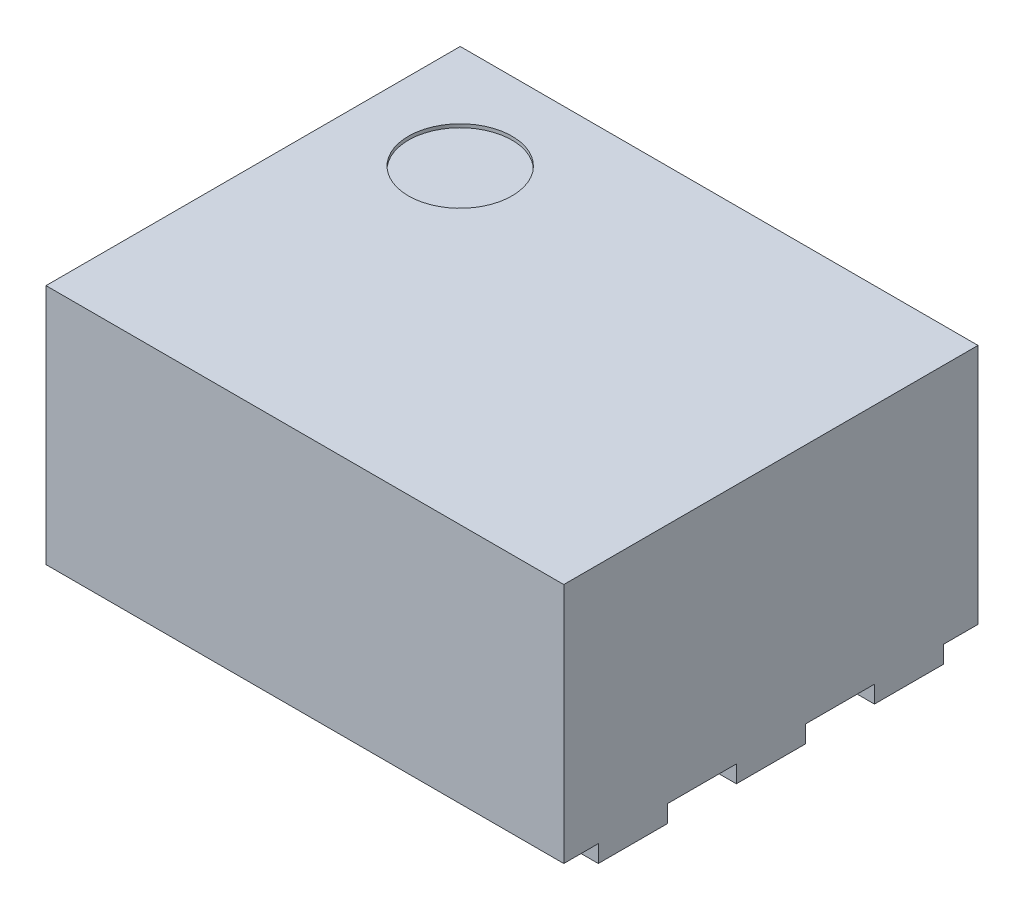
ISO-10303-21;
HEADER;
FILE_DESCRIPTION(('STEP AP214'),'2;1');
FILE_NAME('part.step','',(''),(''),'','','');
FILE_SCHEMA(('AUTOMOTIVE_DESIGN { 1 0 10303 214 1 1 1 1 }'));
ENDSEC;
DATA;
#1=APPLICATION_CONTEXT('core data for automotive mechanical design processes');
#2=APPLICATION_PROTOCOL_DEFINITION('international standard','automotive_design',2000,#1);
#3=PRODUCT_CONTEXT('',#1,'mechanical');
#4=PRODUCT('Part','Part','',(#3));
#5=PRODUCT_RELATED_PRODUCT_CATEGORY('part','',(#4));
#6=PRODUCT_DEFINITION_FORMATION('','',#4);
#7=PRODUCT_DEFINITION_CONTEXT('part definition',#1,'design');
#8=PRODUCT_DEFINITION('design','',#6,#7);
#9=PRODUCT_DEFINITION_SHAPE('','',#8);
#10=(LENGTH_UNIT() NAMED_UNIT(*) SI_UNIT(.MILLI.,.METRE.));
#11=(NAMED_UNIT(*) PLANE_ANGLE_UNIT() SI_UNIT($,.RADIAN.));
#12=(NAMED_UNIT(*) SI_UNIT($,.STERADIAN.) SOLID_ANGLE_UNIT());
#13=UNCERTAINTY_MEASURE_WITH_UNIT(LENGTH_MEASURE(1.E-05),#10,'distance_accuracy_value','');
#14=(GEOMETRIC_REPRESENTATION_CONTEXT(3) GLOBAL_UNCERTAINTY_ASSIGNED_CONTEXT((#13)) GLOBAL_UNIT_ASSIGNED_CONTEXT((#10,
#11,#12)) REPRESENTATION_CONTEXT('',''));
#15=CARTESIAN_POINT('',(0.,0.,0.));
#16=DIRECTION('',(0.,0.,1.));
#17=DIRECTION('',(1.,0.,0.));
#18=AXIS2_PLACEMENT_3D('',#15,#16,#17);
#19=CARTESIAN_POINT('',(0.,0.,0.));
#20=DIRECTION('',(0.,1.,0.));
#21=DIRECTION('',(0.,0.,1.));
#22=AXIS2_PLACEMENT_3D('',#19,#20,#21);
#23=PLANE('',#22);
#24=DIRECTION('',(0.,0.,1.));
#25=VECTOR('',#24,1.);
#26=CARTESIAN_POINT('',(0.235,0.,-0.425));
#27=LINE('',#26,#25);
#28=CARTESIAN_POINT('',(0.235,0.,-0.425));
#29=VERTEX_POINT('',#28);
#30=CARTESIAN_POINT('',(0.235,0.,0.425));
#31=VERTEX_POINT('',#30);
#32=EDGE_CURVE('E483',#29,#31,#27,.T.);
#33=ORIENTED_EDGE('',*,*,#32,.F.);
#34=DIRECTION('',(1.,0.,0.));
#35=VECTOR('',#34,1.);
#36=CARTESIAN_POINT('',(-0.235,0.,-0.425));
#37=LINE('',#36,#35);
#38=CARTESIAN_POINT('',(-0.235,0.,-0.425));
#39=VERTEX_POINT('',#38);
#40=EDGE_CURVE('E470',#39,#29,#37,.T.);
#41=ORIENTED_EDGE('',*,*,#40,.F.);
#42=DIRECTION('',(0.,0.,-1.));
#43=VECTOR('',#42,1.);
#44=CARTESIAN_POINT('',(-0.235,0.,-0.425));
#45=LINE('',#44,#43);
#46=CARTESIAN_POINT('',(-0.235,0.,0.425));
#47=VERTEX_POINT('',#46);
#48=EDGE_CURVE('E474',#47,#39,#45,.T.);
#49=ORIENTED_EDGE('',*,*,#48,.F.);
#50=DIRECTION('',(-1.,0.,0.));
#51=VECTOR('',#50,1.);
#52=CARTESIAN_POINT('',(-0.235,0.,0.425));
#53=LINE('',#52,#51);
#54=EDGE_CURVE('E479',#31,#47,#53,.T.);
#55=ORIENTED_EDGE('',*,*,#54,.F.);
#56=EDGE_LOOP('',(#33,#41,#49,#55));
#57=FACE_BOUND('',#56,.T.);
#58=DIRECTION('',(-1.,0.,0.));
#59=VECTOR('',#58,1.);
#60=CARTESIAN_POINT('',(0.75,0.,0.5));
#61=LINE('',#60,#59);
#62=CARTESIAN_POINT('',(0.75,0.,0.5));
#63=VERTEX_POINT('',#62);
#64=CARTESIAN_POINT('',(0.46,0.,0.5));
#65=VERTEX_POINT('',#64);
#66=EDGE_CURVE('E275',#63,#65,#61,.T.);
#67=ORIENTED_EDGE('',*,*,#66,.F.);
#68=DIRECTION('',(0.,0.,-1.));
#69=VECTOR('',#68,1.);
#70=CARTESIAN_POINT('',(0.75,0.,-0.6));
#71=LINE('',#70,#69);
#72=CARTESIAN_POINT('',(0.75,0.,0.6));
#73=VERTEX_POINT('',#72);
#74=EDGE_CURVE('E555',#73,#63,#71,.T.);
#75=ORIENTED_EDGE('',*,*,#74,.F.);
#76=DIRECTION('',(1.,0.,0.));
#77=VECTOR('',#76,1.);
#78=CARTESIAN_POINT('',(-0.75,0.,0.6));
#79=LINE('',#78,#77);
#80=CARTESIAN_POINT('',(-0.75,0.,0.6));
#81=VERTEX_POINT('',#80);
#82=EDGE_CURVE('E545',#81,#73,#79,.T.);
#83=ORIENTED_EDGE('',*,*,#82,.F.);
#84=DIRECTION('',(0.,0.,1.));
#85=VECTOR('',#84,1.);
#86=CARTESIAN_POINT('',(-0.75,0.,-0.6));
#87=LINE('',#86,#85);
#88=CARTESIAN_POINT('',(-0.75,0.,0.5));
#89=VERTEX_POINT('',#88);
#90=EDGE_CURVE('E562',#89,#81,#87,.T.);
#91=ORIENTED_EDGE('',*,*,#90,.F.);
#92=DIRECTION('',(-1.,0.,0.));
#93=VECTOR('',#92,1.);
#94=CARTESIAN_POINT('',(-0.75,0.,0.5));
#95=LINE('',#94,#93);
#96=CARTESIAN_POINT('',(-0.46,0.,0.5));
#97=VERTEX_POINT('',#96);
#98=EDGE_CURVE('E504',#97,#89,#95,.T.);
#99=ORIENTED_EDGE('',*,*,#98,.F.);
#100=DIRECTION('',(0.,0.,1.));
#101=VECTOR('',#100,1.);
#102=CARTESIAN_POINT('',(-0.46,0.,0.5));
#103=LINE('',#102,#101);
#104=CARTESIAN_POINT('',(-0.46,0.,0.3));
#105=VERTEX_POINT('',#104);
#106=EDGE_CURVE('E517',#105,#97,#103,.T.);
#107=ORIENTED_EDGE('',*,*,#106,.F.);
#108=DIRECTION('',(1.,0.,0.));
#109=VECTOR('',#108,1.);
#110=CARTESIAN_POINT('',(-0.75,0.,0.3));
#111=LINE('',#110,#109);
#112=CARTESIAN_POINT('',(-0.75,0.,0.3));
#113=VERTEX_POINT('',#112);
#114=EDGE_CURVE('E487',#113,#105,#111,.T.);
#115=ORIENTED_EDGE('',*,*,#114,.F.);
#116=CARTESIAN_POINT('',(-0.75,0.,0.0999999999999999));
#117=VERTEX_POINT('',#116);
#118=EDGE_CURVE('E610',#117,#113,#87,.T.);
#119=ORIENTED_EDGE('',*,*,#118,.F.);
#120=DIRECTION('',(-1.,0.,0.));
#121=VECTOR('',#120,1.);
#122=CARTESIAN_POINT('',(-0.75,0.,0.1));
#123=LINE('',#122,#121);
#124=CARTESIAN_POINT('',(-0.46,0.,0.1));
#125=VERTEX_POINT('',#124);
#126=EDGE_CURVE('E431',#125,#117,#123,.T.);
#127=ORIENTED_EDGE('',*,*,#126,.F.);
#128=DIRECTION('',(0.,0.,1.));
#129=VECTOR('',#128,1.);
#130=CARTESIAN_POINT('',(-0.46,0.,0.1));
#131=LINE('',#130,#129);
#132=CARTESIAN_POINT('',(-0.46,0.,-0.1));
#133=VERTEX_POINT('',#132);
#134=EDGE_CURVE('E435',#133,#125,#131,.T.);
#135=ORIENTED_EDGE('',*,*,#134,.F.);
#136=DIRECTION('',(1.,0.,0.));
#137=VECTOR('',#136,1.);
#138=CARTESIAN_POINT('',(-0.75,0.,-0.1));
#139=LINE('',#138,#137);
#140=CARTESIAN_POINT('',(-0.75,0.,-0.1));
#141=VERTEX_POINT('',#140);
#142=EDGE_CURVE('E439',#141,#133,#139,.T.);
#143=ORIENTED_EDGE('',*,*,#142,.F.);
#144=CARTESIAN_POINT('',(-0.75,0.,-0.3));
#145=VERTEX_POINT('',#144);
#146=EDGE_CURVE('E567',#145,#141,#87,.T.);
#147=ORIENTED_EDGE('',*,*,#146,.F.);
#148=DIRECTION('',(-1.,0.,0.));
#149=VECTOR('',#148,1.);
#150=CARTESIAN_POINT('',(-0.75,0.,-0.3));
#151=LINE('',#150,#149);
#152=CARTESIAN_POINT('',(-0.46,0.,-0.3));
#153=VERTEX_POINT('',#152);
#154=EDGE_CURVE('E355',#153,#145,#151,.T.);
#155=ORIENTED_EDGE('',*,*,#154,.F.);
#156=DIRECTION('',(0.,0.,1.));
#157=VECTOR('',#156,1.);
#158=CARTESIAN_POINT('',(-0.46,0.,-0.5));
#159=LINE('',#158,#157);
#160=CARTESIAN_POINT('',(-0.46,0.,-0.5));
#161=VERTEX_POINT('',#160);
#162=EDGE_CURVE('E359',#161,#153,#159,.T.);
#163=ORIENTED_EDGE('',*,*,#162,.F.);
#164=DIRECTION('',(1.,0.,0.));
#165=VECTOR('',#164,1.);
#166=CARTESIAN_POINT('',(-0.75,0.,-0.5));
#167=LINE('',#166,#165);
#168=CARTESIAN_POINT('',(-0.75,0.,-0.5));
#169=VERTEX_POINT('',#168);
#170=EDGE_CURVE('E363',#169,#161,#167,.T.);
#171=ORIENTED_EDGE('',*,*,#170,.F.);
#172=CARTESIAN_POINT('',(-0.75,0.,-0.6));
#173=VERTEX_POINT('',#172);
#174=EDGE_CURVE('E563',#173,#169,#87,.T.);
#175=ORIENTED_EDGE('',*,*,#174,.F.);
#176=DIRECTION('',(-1.,0.,0.));
#177=VECTOR('',#176,1.);
#178=CARTESIAN_POINT('',(-0.75,0.,-0.6));
#179=LINE('',#178,#177);
#180=CARTESIAN_POINT('',(0.75,0.,-0.6));
#181=VERTEX_POINT('',#180);
#182=EDGE_CURVE('E559',#181,#173,#179,.T.);
#183=ORIENTED_EDGE('',*,*,#182,.F.);
#184=CARTESIAN_POINT('',(0.75,0.,-0.5));
#185=VERTEX_POINT('',#184);
#186=EDGE_CURVE('E539',#185,#181,#71,.T.);
#187=ORIENTED_EDGE('',*,*,#186,.F.);
#188=DIRECTION('',(1.,0.,0.));
#189=VECTOR('',#188,1.);
#190=CARTESIAN_POINT('',(0.75,0.,-0.5));
#191=LINE('',#190,#189);
#192=CARTESIAN_POINT('',(0.46,0.,-0.5));
#193=VERTEX_POINT('',#192);
#194=EDGE_CURVE('E401',#193,#185,#191,.T.);
#195=ORIENTED_EDGE('',*,*,#194,.F.);
#196=DIRECTION('',(0.,0.,-1.));
#197=VECTOR('',#196,1.);
#198=CARTESIAN_POINT('',(0.46,0.,-0.5));
#199=LINE('',#198,#197);
#200=CARTESIAN_POINT('',(0.46,0.,-0.3));
#201=VERTEX_POINT('',#200);
#202=EDGE_CURVE('E394',#201,#193,#199,.T.);
#203=ORIENTED_EDGE('',*,*,#202,.F.);
#204=DIRECTION('',(-1.,0.,0.));
#205=VECTOR('',#204,1.);
#206=CARTESIAN_POINT('',(0.75,0.,-0.3));
#207=LINE('',#206,#205);
#208=CARTESIAN_POINT('',(0.75,0.,-0.3));
#209=VERTEX_POINT('',#208);
#210=EDGE_CURVE('E397',#209,#201,#207,.T.);
#211=ORIENTED_EDGE('',*,*,#210,.F.);
#212=CARTESIAN_POINT('',(0.75,0.,-0.0999999999999999));
#213=VERTEX_POINT('',#212);
#214=EDGE_CURVE('E1223',#213,#209,#71,.T.);
#215=ORIENTED_EDGE('',*,*,#214,.F.);
#216=DIRECTION('',(1.,0.,0.));
#217=VECTOR('',#216,1.);
#218=CARTESIAN_POINT('',(0.75,0.,-0.0999999999999999));
#219=LINE('',#218,#217);
#220=CARTESIAN_POINT('',(0.46,0.,-0.0999999999999999));
#221=VERTEX_POINT('',#220);
#222=EDGE_CURVE('E319',#221,#213,#219,.T.);
#223=ORIENTED_EDGE('',*,*,#222,.F.);
#224=DIRECTION('',(0.,0.,-1.));
#225=VECTOR('',#224,1.);
#226=CARTESIAN_POINT('',(0.46,0.,0.1));
#227=LINE('',#226,#225);
#228=CARTESIAN_POINT('',(0.46,0.,0.1));
#229=VERTEX_POINT('',#228);
#230=EDGE_CURVE('E322',#229,#221,#227,.T.);
#231=ORIENTED_EDGE('',*,*,#230,.F.);
#232=DIRECTION('',(-1.,0.,0.));
#233=VECTOR('',#232,1.);
#234=CARTESIAN_POINT('',(0.75,0.,0.1));
#235=LINE('',#234,#233);
#236=CARTESIAN_POINT('',(0.75,0.,0.1));
#237=VERTEX_POINT('',#236);
#238=EDGE_CURVE('E326',#237,#229,#235,.T.);
#239=ORIENTED_EDGE('',*,*,#238,.F.);
#240=CARTESIAN_POINT('',(0.75,0.,0.3));
#241=VERTEX_POINT('',#240);
#242=EDGE_CURVE('E285',#241,#237,#71,.T.);
#243=ORIENTED_EDGE('',*,*,#242,.F.);
#244=DIRECTION('',(1.,0.,0.));
#245=VECTOR('',#244,1.);
#246=CARTESIAN_POINT('',(0.75,0.,0.3));
#247=LINE('',#246,#245);
#248=CARTESIAN_POINT('',(0.46,0.,0.3));
#249=VERTEX_POINT('',#248);
#250=EDGE_CURVE('E276',#249,#241,#247,.T.);
#251=ORIENTED_EDGE('',*,*,#250,.F.);
#252=DIRECTION('',(0.,0.,-1.));
#253=VECTOR('',#252,1.);
#254=CARTESIAN_POINT('',(0.46,0.,0.5));
#255=LINE('',#254,#253);
#256=EDGE_CURVE('E263',#65,#249,#255,.T.);
#257=ORIENTED_EDGE('',*,*,#256,.F.);
#258=EDGE_LOOP('',(#67,#75,#83,#91,#99,#107,#115,#119,#127,#135,#143,#147,#155,#163,#171,#175,
#183,#187,#195,#203,#211,#215,#223,#231,#239,#243,#251,#257));
#259=FACE_BOUND('',#258,.T.);
#260=ADVANCED_FACE('F51',(#57,#259),#23,.F.);
#261=CARTESIAN_POINT('',(0.75,0.7,-0.6));
#262=DIRECTION('',(-1.,0.,0.));
#263=DIRECTION('',(0.,0.,1.));
#264=AXIS2_PLACEMENT_3D('',#261,#262,#263);
#265=PLANE('',#264);
#266=ORIENTED_EDGE('',*,*,#74,.T.);
#267=DIRECTION('',(0.,1.,0.));
#268=VECTOR('',#267,1.);
#269=CARTESIAN_POINT('',(0.75,-0.05,0.5));
#270=LINE('',#269,#268);
#271=CARTESIAN_POINT('',(0.75,-0.05,0.5));
#272=VERTEX_POINT('',#271);
#273=EDGE_CURVE('E625',#272,#63,#270,.T.);
#274=ORIENTED_EDGE('',*,*,#273,.F.);
#275=DIRECTION('',(0.,0.,1.));
#276=VECTOR('',#275,1.);
#277=CARTESIAN_POINT('',(0.75,-0.05,0.5));
#278=LINE('',#277,#276);
#279=CARTESIAN_POINT('',(0.75,-0.05,0.3));
#280=VERTEX_POINT('',#279);
#281=EDGE_CURVE('E287',#280,#272,#278,.T.);
#282=ORIENTED_EDGE('',*,*,#281,.F.);
#283=DIRECTION('',(0.,1.,0.));
#284=VECTOR('',#283,1.);
#285=CARTESIAN_POINT('',(0.75,-0.05,0.3));
#286=LINE('',#285,#284);
#287=EDGE_CURVE('E67',#280,#241,#286,.T.);
#288=ORIENTED_EDGE('',*,*,#287,.T.);
#289=ORIENTED_EDGE('',*,*,#242,.T.);
#290=DIRECTION('',(0.,1.,0.));
#291=VECTOR('',#290,1.);
#292=CARTESIAN_POINT('',(0.75,-0.05,0.1));
#293=LINE('',#292,#291);
#294=CARTESIAN_POINT('',(0.75,-0.05,0.1));
#295=VERTEX_POINT('',#294);
#296=EDGE_CURVE('E297',#295,#237,#293,.T.);
#297=ORIENTED_EDGE('',*,*,#296,.F.);
#298=DIRECTION('',(0.,0.,1.));
#299=VECTOR('',#298,1.);
#300=CARTESIAN_POINT('',(0.75,-0.05,0.1));
#301=LINE('',#300,#299);
#302=CARTESIAN_POINT('',(0.75,-0.05,-0.0999999999999999));
#303=VERTEX_POINT('',#302);
#304=EDGE_CURVE('E323',#303,#295,#301,.T.);
#305=ORIENTED_EDGE('',*,*,#304,.F.);
#306=DIRECTION('',(0.,1.,0.));
#307=VECTOR('',#306,1.);
#308=CARTESIAN_POINT('',(0.75,-0.05,-0.0999999999999999));
#309=LINE('',#308,#307);
#310=EDGE_CURVE('E74',#303,#213,#309,.T.);
#311=ORIENTED_EDGE('',*,*,#310,.T.);
#312=ORIENTED_EDGE('',*,*,#214,.T.);
#313=DIRECTION('',(0.,1.,0.));
#314=VECTOR('',#313,1.);
#315=CARTESIAN_POINT('',(0.75,-0.05,-0.3));
#316=LINE('',#315,#314);
#317=CARTESIAN_POINT('',(0.75,-0.05,-0.3));
#318=VERTEX_POINT('',#317);
#319=EDGE_CURVE('E381',#318,#209,#316,.T.);
#320=ORIENTED_EDGE('',*,*,#319,.F.);
#321=DIRECTION('',(0.,0.,1.));
#322=VECTOR('',#321,1.);
#323=CARTESIAN_POINT('',(0.75,-0.05,-0.5));
#324=LINE('',#323,#322);
#325=CARTESIAN_POINT('',(0.75,-0.05,-0.5));
#326=VERTEX_POINT('',#325);
#327=EDGE_CURVE('E410',#326,#318,#324,.T.);
#328=ORIENTED_EDGE('',*,*,#327,.F.);
#329=DIRECTION('',(0.,1.,0.));
#330=VECTOR('',#329,1.);
#331=CARTESIAN_POINT('',(0.75,-0.05,-0.5));
#332=LINE('',#331,#330);
#333=EDGE_CURVE('E366',#326,#185,#332,.T.);
#334=ORIENTED_EDGE('',*,*,#333,.T.);
#335=ORIENTED_EDGE('',*,*,#186,.T.);
#336=DIRECTION('',(0.,-1.,0.));
#337=VECTOR('',#336,1.);
#338=CARTESIAN_POINT('',(0.75,0.7,-0.6));
#339=LINE('',#338,#337);
#340=CARTESIAN_POINT('',(0.75,0.7,-0.6));
#341=VERTEX_POINT('',#340);
#342=EDGE_CURVE('E11',#341,#181,#339,.T.);
#343=ORIENTED_EDGE('',*,*,#342,.F.);
#344=DIRECTION('',(0.,0.,-1.));
#345=VECTOR('',#344,1.);
#346=CARTESIAN_POINT('',(0.75,0.7,-0.6));
#347=LINE('',#346,#345);
#348=CARTESIAN_POINT('',(0.75,0.7,0.6));
#349=VERTEX_POINT('',#348);
#350=EDGE_CURVE('E540',#349,#341,#347,.T.);
#351=ORIENTED_EDGE('',*,*,#350,.F.);
#352=DIRECTION('',(0.,-1.,0.));
#353=VECTOR('',#352,1.);
#354=CARTESIAN_POINT('',(0.75,0.7,0.6));
#355=LINE('',#354,#353);
#356=EDGE_CURVE('E554',#349,#73,#355,.T.);
#357=ORIENTED_EDGE('',*,*,#356,.T.);
#358=EDGE_LOOP('',(#266,#274,#282,#288,#289,#297,#305,#311,#312,#320,#328,#334,#335,#343,#351,#357));
#359=FACE_BOUND('',#358,.T.);
#360=ADVANCED_FACE('F53',(#359),#265,.F.);
#361=CARTESIAN_POINT('',(-0.75,0.7,-0.6));
#362=DIRECTION('',(0.,0.,1.));
#363=DIRECTION('',(1.,0.,0.));
#364=AXIS2_PLACEMENT_3D('',#361,#362,#363);
#365=PLANE('',#364);
#366=ORIENTED_EDGE('',*,*,#182,.T.);
#367=DIRECTION('',(0.,-1.,0.));
#368=VECTOR('',#367,1.);
#369=CARTESIAN_POINT('',(-0.75,0.7,-0.6));
#370=LINE('',#369,#368);
#371=CARTESIAN_POINT('',(-0.75,0.7,-0.6));
#372=VERTEX_POINT('',#371);
#373=EDGE_CURVE('E60',#372,#173,#370,.T.);
#374=ORIENTED_EDGE('',*,*,#373,.F.);
#375=DIRECTION('',(-1.,0.,0.));
#376=VECTOR('',#375,1.);
#377=CARTESIAN_POINT('',(-0.75,0.7,-0.6));
#378=LINE('',#377,#376);
#379=EDGE_CURVE('E544',#341,#372,#378,.T.);
#380=ORIENTED_EDGE('',*,*,#379,.F.);
#381=ORIENTED_EDGE('',*,*,#342,.T.);
#382=EDGE_LOOP('',(#366,#374,#380,#381));
#383=FACE_BOUND('',#382,.T.);
#384=ADVANCED_FACE('F630',(#383),#365,.F.);
#385=CARTESIAN_POINT('',(-0.75,0.7,-0.6));
#386=DIRECTION('',(1.,0.,0.));
#387=DIRECTION('',(0.,0.,-1.));
#388=AXIS2_PLACEMENT_3D('',#385,#386,#387);
#389=PLANE('',#388);
#390=ORIENTED_EDGE('',*,*,#174,.T.);
#391=DIRECTION('',(0.,1.,0.));
#392=VECTOR('',#391,1.);
#393=CARTESIAN_POINT('',(-0.75,-0.05,-0.5));
#394=LINE('',#393,#392);
#395=CARTESIAN_POINT('',(-0.75,-0.05,-0.5));
#396=VERTEX_POINT('',#395);
#397=EDGE_CURVE('E329',#396,#169,#394,.T.);
#398=ORIENTED_EDGE('',*,*,#397,.F.);
#399=DIRECTION('',(0.,0.,-1.));
#400=VECTOR('',#399,1.);
#401=CARTESIAN_POINT('',(-0.75,-0.05,-0.5));
#402=LINE('',#401,#400);
#403=CARTESIAN_POINT('',(-0.75,-0.05,-0.3));
#404=VERTEX_POINT('',#403);
#405=EDGE_CURVE('E360',#404,#396,#402,.T.);
#406=ORIENTED_EDGE('',*,*,#405,.F.);
#407=DIRECTION('',(0.,1.,0.));
#408=VECTOR('',#407,1.);
#409=CARTESIAN_POINT('',(-0.75,-0.05,-0.3));
#410=LINE('',#409,#408);
#411=EDGE_CURVE('E351',#404,#145,#410,.T.);
#412=ORIENTED_EDGE('',*,*,#411,.T.);
#413=ORIENTED_EDGE('',*,*,#146,.T.);
#414=DIRECTION('',(0.,1.,0.));
#415=VECTOR('',#414,1.);
#416=CARTESIAN_POINT('',(-0.75,-0.05,-0.1));
#417=LINE('',#416,#415);
#418=CARTESIAN_POINT('',(-0.75,-0.05,-0.1));
#419=VERTEX_POINT('',#418);
#420=EDGE_CURVE('E404',#419,#141,#417,.T.);
#421=ORIENTED_EDGE('',*,*,#420,.F.);
#422=DIRECTION('',(0.,0.,-1.));
#423=VECTOR('',#422,1.);
#424=CARTESIAN_POINT('',(-0.75,-0.05,0.1));
#425=LINE('',#424,#423);
#426=CARTESIAN_POINT('',(-0.75,-0.05,0.1));
#427=VERTEX_POINT('',#426);
#428=EDGE_CURVE('E436',#427,#419,#425,.T.);
#429=ORIENTED_EDGE('',*,*,#428,.F.);
#430=DIRECTION('',(0.,1.,0.));
#431=VECTOR('',#430,1.);
#432=CARTESIAN_POINT('',(-0.75,-0.05,0.1));
#433=LINE('',#432,#431);
#434=EDGE_CURVE('E427',#427,#117,#433,.T.);
#435=ORIENTED_EDGE('',*,*,#434,.T.);
#436=ORIENTED_EDGE('',*,*,#118,.T.);
#437=DIRECTION('',(0.,1.,0.));
#438=VECTOR('',#437,1.);
#439=CARTESIAN_POINT('',(-0.75,-0.05,0.3));
#440=LINE('',#439,#438);
#441=CARTESIAN_POINT('',(-0.75,-0.05,0.3));
#442=VERTEX_POINT('',#441);
#443=EDGE_CURVE('E535',#442,#113,#440,.T.);
#444=ORIENTED_EDGE('',*,*,#443,.F.);
#445=DIRECTION('',(0.,0.,-1.));
#446=VECTOR('',#445,1.);
#447=CARTESIAN_POINT('',(-0.75,-0.05,0.5));
#448=LINE('',#447,#446);
#449=CARTESIAN_POINT('',(-0.75,-0.05,0.5));
#450=VERTEX_POINT('',#449);
#451=EDGE_CURVE('E499',#450,#442,#448,.T.);
#452=ORIENTED_EDGE('',*,*,#451,.F.);
#453=DIRECTION('',(0.,1.,0.));
#454=VECTOR('',#453,1.);
#455=CARTESIAN_POINT('',(-0.75,-0.05,0.5));
#456=LINE('',#455,#454);
#457=EDGE_CURVE('E513',#450,#89,#456,.T.);
#458=ORIENTED_EDGE('',*,*,#457,.T.);
#459=ORIENTED_EDGE('',*,*,#90,.T.);
#460=DIRECTION('',(0.,-1.,0.));
#461=VECTOR('',#460,1.);
#462=CARTESIAN_POINT('',(-0.75,0.7,0.6));
#463=LINE('',#462,#461);
#464=CARTESIAN_POINT('',(-0.75,0.7,0.6));
#465=VERTEX_POINT('',#464);
#466=EDGE_CURVE('E573',#465,#81,#463,.T.);
#467=ORIENTED_EDGE('',*,*,#466,.F.);
#468=DIRECTION('',(0.,0.,1.));
#469=VECTOR('',#468,1.);
#470=CARTESIAN_POINT('',(-0.75,0.7,-0.6));
#471=LINE('',#470,#469);
#472=EDGE_CURVE('E548',#372,#465,#471,.T.);
#473=ORIENTED_EDGE('',*,*,#472,.F.);
#474=ORIENTED_EDGE('',*,*,#373,.T.);
#475=EDGE_LOOP('',(#390,#398,#406,#412,#413,#421,#429,#435,#436,#444,#452,#458,#459,#467,#473,#474));
#476=FACE_BOUND('',#475,.T.);
#477=ADVANCED_FACE('F582',(#476),#389,.F.);
#478=CARTESIAN_POINT('',(-0.75,0.7,0.6));
#479=DIRECTION('',(0.,0.,-1.));
#480=DIRECTION('',(-1.,0.,0.));
#481=AXIS2_PLACEMENT_3D('',#478,#479,#480);
#482=PLANE('',#481);
#483=ORIENTED_EDGE('',*,*,#82,.T.);
#484=ORIENTED_EDGE('',*,*,#356,.F.);
#485=DIRECTION('',(1.,0.,0.));
#486=VECTOR('',#485,1.);
#487=CARTESIAN_POINT('',(-0.75,0.7,0.6));
#488=LINE('',#487,#486);
#489=EDGE_CURVE('E551',#465,#349,#488,.T.);
#490=ORIENTED_EDGE('',*,*,#489,.F.);
#491=ORIENTED_EDGE('',*,*,#466,.T.);
#492=EDGE_LOOP('',(#483,#484,#490,#491));
#493=FACE_BOUND('',#492,.T.);
#494=ADVANCED_FACE('F621',(#493),#482,.F.);
#495=CARTESIAN_POINT('',(0.,0.7,0.));
#496=DIRECTION('',(0.,1.,0.));
#497=DIRECTION('',(0.,0.,1.));
#498=AXIS2_PLACEMENT_3D('',#495,#496,#497);
#499=PLANE('',#498);
#500=CARTESIAN_POINT('',(-0.45,0.7,-0.3));
#501=DIRECTION('',(0.,1.,0.));
#502=DIRECTION('',(0.,0.,1.));
#503=AXIS2_PLACEMENT_3D('',#500,#501,#502);
#504=CIRCLE('',#503,0.15);
#505=CARTESIAN_POINT('',(-0.45,0.7,-0.15));
#506=VERTEX_POINT('',#505);
#507=EDGE_CURVE('E660',#506,#506,#504,.T.);
#508=ORIENTED_EDGE('',*,*,#507,.F.);
#509=EDGE_LOOP('',(#508));
#510=FACE_BOUND('',#509,.T.);
#511=ORIENTED_EDGE('',*,*,#350,.T.);
#512=ORIENTED_EDGE('',*,*,#379,.T.);
#513=ORIENTED_EDGE('',*,*,#472,.T.);
#514=ORIENTED_EDGE('',*,*,#489,.T.);
#515=EDGE_LOOP('',(#511,#512,#513,#514));
#516=FACE_BOUND('',#515,.T.);
#517=ADVANCED_FACE('F629',(#510,#516),#499,.T.);
#518=CARTESIAN_POINT('',(-0.75,-0.05,0.3));
#519=DIRECTION('',(0.,0.,1.));
#520=DIRECTION('',(1.,0.,0.));
#521=AXIS2_PLACEMENT_3D('',#518,#519,#520);
#522=PLANE('',#521);
#523=ORIENTED_EDGE('',*,*,#114,.T.);
#524=DIRECTION('',(0.,1.,0.));
#525=VECTOR('',#524,1.);
#526=CARTESIAN_POINT('',(-0.46,-0.05,0.3));
#527=LINE('',#526,#525);
#528=CARTESIAN_POINT('',(-0.46,-0.05,0.3));
#529=VERTEX_POINT('',#528);
#530=EDGE_CURVE('E531',#529,#105,#527,.T.);
#531=ORIENTED_EDGE('',*,*,#530,.F.);
#532=DIRECTION('',(1.,0.,0.));
#533=VECTOR('',#532,1.);
#534=CARTESIAN_POINT('',(-0.75,-0.05,0.3));
#535=LINE('',#534,#533);
#536=EDGE_CURVE('E503',#442,#529,#535,.T.);
#537=ORIENTED_EDGE('',*,*,#536,.F.);
#538=ORIENTED_EDGE('',*,*,#443,.T.);
#539=EDGE_LOOP('',(#523,#531,#537,#538));
#540=FACE_BOUND('',#539,.T.);
#541=ADVANCED_FACE('F649',(#540),#522,.F.);
#542=CARTESIAN_POINT('',(-0.46,-0.05,0.5));
#543=DIRECTION('',(-1.,0.,0.));
#544=DIRECTION('',(0.,0.,1.));
#545=AXIS2_PLACEMENT_3D('',#542,#543,#544);
#546=PLANE('',#545);
#547=ORIENTED_EDGE('',*,*,#106,.T.);
#548=DIRECTION('',(0.,1.,0.));
#549=VECTOR('',#548,1.);
#550=CARTESIAN_POINT('',(-0.46,-0.05,0.5));
#551=LINE('',#550,#549);
#552=CARTESIAN_POINT('',(-0.46,-0.05,0.5));
#553=VERTEX_POINT('',#552);
#554=EDGE_CURVE('E527',#553,#97,#551,.T.);
#555=ORIENTED_EDGE('',*,*,#554,.F.);
#556=DIRECTION('',(0.,0.,1.));
#557=VECTOR('',#556,1.);
#558=CARTESIAN_POINT('',(-0.46,-0.05,0.5));
#559=LINE('',#558,#557);
#560=EDGE_CURVE('E507',#529,#553,#559,.T.);
#561=ORIENTED_EDGE('',*,*,#560,.F.);
#562=ORIENTED_EDGE('',*,*,#530,.T.);
#563=EDGE_LOOP('',(#547,#555,#561,#562));
#564=FACE_BOUND('',#563,.T.);
#565=ADVANCED_FACE('F656',(#564),#546,.F.);
#566=CARTESIAN_POINT('',(-0.75,-0.05,0.5));
#567=DIRECTION('',(0.,0.,-1.));
#568=DIRECTION('',(-1.,0.,0.));
#569=AXIS2_PLACEMENT_3D('',#566,#567,#568);
#570=PLANE('',#569);
#571=ORIENTED_EDGE('',*,*,#98,.T.);
#572=ORIENTED_EDGE('',*,*,#457,.F.);
#573=DIRECTION('',(-1.,0.,0.));
#574=VECTOR('',#573,1.);
#575=CARTESIAN_POINT('',(-0.75,-0.05,0.5));
#576=LINE('',#575,#574);
#577=EDGE_CURVE('E510',#553,#450,#576,.T.);
#578=ORIENTED_EDGE('',*,*,#577,.F.);
#579=ORIENTED_EDGE('',*,*,#554,.T.);
#580=EDGE_LOOP('',(#571,#572,#578,#579));
#581=FACE_BOUND('',#580,.T.);
#582=ADVANCED_FACE('F769',(#581),#570,.F.);
#583=CARTESIAN_POINT('',(0.,-0.05,0.));
#584=DIRECTION('',(0.,-1.,0.));
#585=DIRECTION('',(0.,0.,-1.));
#586=AXIS2_PLACEMENT_3D('',#583,#584,#585);
#587=PLANE('',#586);
#588=ORIENTED_EDGE('',*,*,#451,.T.);
#589=ORIENTED_EDGE('',*,*,#536,.T.);
#590=ORIENTED_EDGE('',*,*,#560,.T.);
#591=ORIENTED_EDGE('',*,*,#577,.T.);
#592=EDGE_LOOP('',(#588,#589,#590,#591));
#593=FACE_BOUND('',#592,.T.);
#594=ADVANCED_FACE('F751',(#593),#587,.T.);
#595=CARTESIAN_POINT('',(0.235,-0.05,-0.425));
#596=DIRECTION('',(-1.,0.,0.));
#597=DIRECTION('',(0.,0.,1.));
#598=AXIS2_PLACEMENT_3D('',#595,#596,#597);
#599=PLANE('',#598);
#600=ORIENTED_EDGE('',*,*,#32,.T.);
#601=DIRECTION('',(0.,1.,0.));
#602=VECTOR('',#601,1.);
#603=CARTESIAN_POINT('',(0.235,-0.05,0.425));
#604=LINE('',#603,#602);
#605=CARTESIAN_POINT('',(0.235,-0.05,0.425));
#606=VERTEX_POINT('',#605);
#607=EDGE_CURVE('E442',#606,#31,#604,.T.);
#608=ORIENTED_EDGE('',*,*,#607,.F.);
#609=DIRECTION('',(0.,0.,1.));
#610=VECTOR('',#609,1.);
#611=CARTESIAN_POINT('',(0.235,-0.05,-0.425));
#612=LINE('',#611,#610);
#613=CARTESIAN_POINT('',(0.235,-0.05,-0.425));
#614=VERTEX_POINT('',#613);
#615=EDGE_CURVE('E475',#614,#606,#612,.T.);
#616=ORIENTED_EDGE('',*,*,#615,.F.);
#617=DIRECTION('',(0.,1.,0.));
#618=VECTOR('',#617,1.);
#619=CARTESIAN_POINT('',(0.235,-0.05,-0.425));
#620=LINE('',#619,#618);
#621=EDGE_CURVE('E465',#614,#29,#620,.T.);
#622=ORIENTED_EDGE('',*,*,#621,.T.);
#623=EDGE_LOOP('',(#600,#608,#616,#622));
#624=FACE_BOUND('',#623,.T.);
#625=ADVANCED_FACE('F747',(#624),#599,.F.);
#626=CARTESIAN_POINT('',(-0.235,-0.05,0.425));
#627=DIRECTION('',(0.,0.,-1.));
#628=DIRECTION('',(-1.,0.,0.));
#629=AXIS2_PLACEMENT_3D('',#626,#627,#628);
#630=PLANE('',#629);
#631=ORIENTED_EDGE('',*,*,#54,.T.);
#632=DIRECTION('',(0.,1.,0.));
#633=VECTOR('',#632,1.);
#634=CARTESIAN_POINT('',(-0.235,-0.05,0.425));
#635=LINE('',#634,#633);
#636=CARTESIAN_POINT('',(-0.235,-0.05,0.425));
#637=VERTEX_POINT('',#636);
#638=EDGE_CURVE('E457',#637,#47,#635,.T.);
#639=ORIENTED_EDGE('',*,*,#638,.F.);
#640=DIRECTION('',(-1.,0.,0.));
#641=VECTOR('',#640,1.);
#642=CARTESIAN_POINT('',(-0.235,-0.05,0.425));
#643=LINE('',#642,#641);
#644=EDGE_CURVE('E493',#606,#637,#643,.T.);
#645=ORIENTED_EDGE('',*,*,#644,.F.);
#646=ORIENTED_EDGE('',*,*,#607,.T.);
#647=EDGE_LOOP('',(#631,#639,#645,#646));
#648=FACE_BOUND('',#647,.T.);
#649=ADVANCED_FACE('F750',(#648),#630,.F.);
#650=CARTESIAN_POINT('',(-0.235,-0.05,-0.425));
#651=DIRECTION('',(1.,0.,0.));
#652=DIRECTION('',(0.,0.,-1.));
#653=AXIS2_PLACEMENT_3D('',#650,#651,#652);
#654=PLANE('',#653);
#655=ORIENTED_EDGE('',*,*,#48,.T.);
#656=DIRECTION('',(0.,1.,0.));
#657=VECTOR('',#656,1.);
#658=CARTESIAN_POINT('',(-0.235,-0.05,-0.425));
#659=LINE('',#658,#657);
#660=CARTESIAN_POINT('',(-0.235,-0.05,-0.425));
#661=VERTEX_POINT('',#660);
#662=EDGE_CURVE('E461',#661,#39,#659,.T.);
#663=ORIENTED_EDGE('',*,*,#662,.F.);
#664=DIRECTION('',(0.,0.,-1.));
#665=VECTOR('',#664,1.);
#666=CARTESIAN_POINT('',(-0.235,-0.05,-0.425));
#667=LINE('',#666,#665);
#668=EDGE_CURVE('E490',#637,#661,#667,.T.);
#669=ORIENTED_EDGE('',*,*,#668,.F.);
#670=ORIENTED_EDGE('',*,*,#638,.T.);
#671=EDGE_LOOP('',(#655,#663,#669,#670));
#672=FACE_BOUND('',#671,.T.);
#673=ADVANCED_FACE('F755',(#672),#654,.F.);
#674=CARTESIAN_POINT('',(-0.235,-0.05,-0.425));
#675=DIRECTION('',(0.,0.,1.));
#676=DIRECTION('',(1.,0.,0.));
#677=AXIS2_PLACEMENT_3D('',#674,#675,#676);
#678=PLANE('',#677);
#679=ORIENTED_EDGE('',*,*,#40,.T.);
#680=ORIENTED_EDGE('',*,*,#621,.F.);
#681=DIRECTION('',(1.,0.,0.));
#682=VECTOR('',#681,1.);
#683=CARTESIAN_POINT('',(-0.235,-0.05,-0.425));
#684=LINE('',#683,#682);
#685=EDGE_CURVE('E469',#661,#614,#684,.T.);
#686=ORIENTED_EDGE('',*,*,#685,.F.);
#687=ORIENTED_EDGE('',*,*,#662,.T.);
#688=EDGE_LOOP('',(#679,#680,#686,#687));
#689=FACE_BOUND('',#688,.T.);
#690=ADVANCED_FACE('F759',(#689),#678,.F.);
#691=CARTESIAN_POINT('',(0.,-0.05,0.));
#692=DIRECTION('',(0.,1.,0.));
#693=DIRECTION('',(0.,0.,1.));
#694=AXIS2_PLACEMENT_3D('',#691,#692,#693);
#695=PLANE('',#694);
#696=ORIENTED_EDGE('',*,*,#615,.T.);
#697=ORIENTED_EDGE('',*,*,#644,.T.);
#698=ORIENTED_EDGE('',*,*,#668,.T.);
#699=ORIENTED_EDGE('',*,*,#685,.T.);
#700=EDGE_LOOP('',(#696,#697,#698,#699));
#701=FACE_BOUND('',#700,.T.);
#702=ADVANCED_FACE('F735',(#701),#695,.F.);
#703=CARTESIAN_POINT('',(-0.75,-0.05,-0.1));
#704=DIRECTION('',(0.,0.,1.));
#705=DIRECTION('',(1.,0.,0.));
#706=AXIS2_PLACEMENT_3D('',#703,#704,#705);
#707=PLANE('',#706);
#708=ORIENTED_EDGE('',*,*,#142,.T.);
#709=DIRECTION('',(0.,1.,0.));
#710=VECTOR('',#709,1.);
#711=CARTESIAN_POINT('',(-0.46,-0.05,-0.1));
#712=LINE('',#711,#710);
#713=CARTESIAN_POINT('',(-0.46,-0.05,-0.1));
#714=VERTEX_POINT('',#713);
#715=EDGE_CURVE('E419',#714,#133,#712,.T.);
#716=ORIENTED_EDGE('',*,*,#715,.F.);
#717=DIRECTION('',(1.,0.,0.));
#718=VECTOR('',#717,1.);
#719=CARTESIAN_POINT('',(-0.75,-0.05,-0.1));
#720=LINE('',#719,#718);
#721=EDGE_CURVE('E448',#419,#714,#720,.T.);
#722=ORIENTED_EDGE('',*,*,#721,.F.);
#723=ORIENTED_EDGE('',*,*,#420,.T.);
#724=EDGE_LOOP('',(#708,#716,#722,#723));
#725=FACE_BOUND('',#724,.T.);
#726=ADVANCED_FACE('F731',(#725),#707,.F.);
#727=CARTESIAN_POINT('',(-0.46,-0.05,0.1));
#728=DIRECTION('',(-1.,0.,0.));
#729=DIRECTION('',(0.,0.,1.));
#730=AXIS2_PLACEMENT_3D('',#727,#728,#729);
#731=PLANE('',#730);
#732=ORIENTED_EDGE('',*,*,#134,.T.);
#733=DIRECTION('',(0.,1.,0.));
#734=VECTOR('',#733,1.);
#735=CARTESIAN_POINT('',(-0.46,-0.05,0.1));
#736=LINE('',#735,#734);
#737=CARTESIAN_POINT('',(-0.46,-0.05,0.1));
#738=VERTEX_POINT('',#737);
#739=EDGE_CURVE('E423',#738,#125,#736,.T.);
#740=ORIENTED_EDGE('',*,*,#739,.F.);
#741=DIRECTION('',(0.,0.,1.));
#742=VECTOR('',#741,1.);
#743=CARTESIAN_POINT('',(-0.46,-0.05,0.1));
#744=LINE('',#743,#742);
#745=EDGE_CURVE('E445',#714,#738,#744,.T.);
#746=ORIENTED_EDGE('',*,*,#745,.F.);
#747=ORIENTED_EDGE('',*,*,#715,.T.);
#748=EDGE_LOOP('',(#732,#740,#746,#747));
#749=FACE_BOUND('',#748,.T.);
#750=ADVANCED_FACE('F734',(#749),#731,.F.);
#751=CARTESIAN_POINT('',(-0.75,-0.05,0.1));
#752=DIRECTION('',(0.,0.,-1.));
#753=DIRECTION('',(-1.,0.,0.));
#754=AXIS2_PLACEMENT_3D('',#751,#752,#753);
#755=PLANE('',#754);
#756=ORIENTED_EDGE('',*,*,#126,.T.);
#757=ORIENTED_EDGE('',*,*,#434,.F.);
#758=DIRECTION('',(-1.,0.,0.));
#759=VECTOR('',#758,1.);
#760=CARTESIAN_POINT('',(-0.75,-0.05,0.1));
#761=LINE('',#760,#759);
#762=EDGE_CURVE('E430',#738,#427,#761,.T.);
#763=ORIENTED_EDGE('',*,*,#762,.F.);
#764=ORIENTED_EDGE('',*,*,#739,.T.);
#765=EDGE_LOOP('',(#756,#757,#763,#764));
#766=FACE_BOUND('',#765,.T.);
#767=ADVANCED_FACE('F739',(#766),#755,.F.);
#768=CARTESIAN_POINT('',(0.,-0.05,0.));
#769=DIRECTION('',(0.,-1.,0.));
#770=DIRECTION('',(0.,0.,-1.));
#771=AXIS2_PLACEMENT_3D('',#768,#769,#770);
#772=PLANE('',#771);
#773=ORIENTED_EDGE('',*,*,#428,.T.);
#774=ORIENTED_EDGE('',*,*,#721,.T.);
#775=ORIENTED_EDGE('',*,*,#745,.T.);
#776=ORIENTED_EDGE('',*,*,#762,.T.);
#777=EDGE_LOOP('',(#773,#774,#775,#776));
#778=FACE_BOUND('',#777,.T.);
#779=ADVANCED_FACE('F719',(#778),#772,.T.);
#780=CARTESIAN_POINT('',(0.75,-0.05,-0.5));
#781=DIRECTION('',(0.,0.,1.));
#782=DIRECTION('',(1.,0.,0.));
#783=AXIS2_PLACEMENT_3D('',#780,#781,#782);
#784=PLANE('',#783);
#785=ORIENTED_EDGE('',*,*,#194,.T.);
#786=ORIENTED_EDGE('',*,*,#333,.F.);
#787=DIRECTION('',(1.,0.,0.));
#788=VECTOR('',#787,1.);
#789=CARTESIAN_POINT('',(0.75,-0.05,-0.5));
#790=LINE('',#789,#788);
#791=CARTESIAN_POINT('',(0.46,-0.05,-0.5));
#792=VERTEX_POINT('',#791);
#793=EDGE_CURVE('E398',#792,#326,#790,.T.);
#794=ORIENTED_EDGE('',*,*,#793,.F.);
#795=DIRECTION('',(0.,1.,0.));
#796=VECTOR('',#795,1.);
#797=CARTESIAN_POINT('',(0.46,-0.05,-0.5));
#798=LINE('',#797,#796);
#799=EDGE_CURVE('E389',#792,#193,#798,.T.);
#800=ORIENTED_EDGE('',*,*,#799,.T.);
#801=EDGE_LOOP('',(#785,#786,#794,#800));
#802=FACE_BOUND('',#801,.T.);
#803=ADVANCED_FACE('F715',(#802),#784,.F.);
#804=CARTESIAN_POINT('',(0.75,-0.05,-0.3));
#805=DIRECTION('',(0.,0.,-1.));
#806=DIRECTION('',(-1.,0.,0.));
#807=AXIS2_PLACEMENT_3D('',#804,#805,#806);
#808=PLANE('',#807);
#809=ORIENTED_EDGE('',*,*,#210,.T.);
#810=DIRECTION('',(0.,1.,0.));
#811=VECTOR('',#810,1.);
#812=CARTESIAN_POINT('',(0.46,-0.05,-0.3));
#813=LINE('',#812,#811);
#814=CARTESIAN_POINT('',(0.46,-0.05,-0.3));
#815=VERTEX_POINT('',#814);
#816=EDGE_CURVE('E385',#815,#201,#813,.T.);
#817=ORIENTED_EDGE('',*,*,#816,.F.);
#818=DIRECTION('',(-1.,0.,0.));
#819=VECTOR('',#818,1.);
#820=CARTESIAN_POINT('',(0.75,-0.05,-0.3));
#821=LINE('',#820,#819);
#822=EDGE_CURVE('E407',#318,#815,#821,.T.);
#823=ORIENTED_EDGE('',*,*,#822,.F.);
#824=ORIENTED_EDGE('',*,*,#319,.T.);
#825=EDGE_LOOP('',(#809,#817,#823,#824));
#826=FACE_BOUND('',#825,.T.);
#827=ADVANCED_FACE('F718',(#826),#808,.F.);
#828=CARTESIAN_POINT('',(0.46,-0.05,-0.5));
#829=DIRECTION('',(1.,0.,0.));
#830=DIRECTION('',(0.,0.,-1.));
#831=AXIS2_PLACEMENT_3D('',#828,#829,#830);
#832=PLANE('',#831);
#833=ORIENTED_EDGE('',*,*,#202,.T.);
#834=ORIENTED_EDGE('',*,*,#799,.F.);
#835=DIRECTION('',(0.,0.,-1.));
#836=VECTOR('',#835,1.);
#837=CARTESIAN_POINT('',(0.46,-0.05,-0.5));
#838=LINE('',#837,#836);
#839=EDGE_CURVE('E393',#815,#792,#838,.T.);
#840=ORIENTED_EDGE('',*,*,#839,.F.);
#841=ORIENTED_EDGE('',*,*,#816,.T.);
#842=EDGE_LOOP('',(#833,#834,#840,#841));
#843=FACE_BOUND('',#842,.T.);
#844=ADVANCED_FACE('F723',(#843),#832,.F.);
#845=CARTESIAN_POINT('',(0.,-0.05,0.));
#846=DIRECTION('',(0.,1.,0.));
#847=DIRECTION('',(0.,0.,1.));
#848=AXIS2_PLACEMENT_3D('',#845,#846,#847);
#849=PLANE('',#848);
#850=ORIENTED_EDGE('',*,*,#793,.T.);
#851=ORIENTED_EDGE('',*,*,#327,.T.);
#852=ORIENTED_EDGE('',*,*,#822,.T.);
#853=ORIENTED_EDGE('',*,*,#839,.T.);
#854=EDGE_LOOP('',(#850,#851,#852,#853));
#855=FACE_BOUND('',#854,.T.);
#856=ADVANCED_FACE('F708',(#855),#849,.F.);
#857=CARTESIAN_POINT('',(-0.75,-0.05,-0.5));
#858=DIRECTION('',(0.,0.,1.));
#859=DIRECTION('',(1.,0.,0.));
#860=AXIS2_PLACEMENT_3D('',#857,#858,#859);
#861=PLANE('',#860);
#862=ORIENTED_EDGE('',*,*,#170,.T.);
#863=DIRECTION('',(0.,1.,0.));
#864=VECTOR('',#863,1.);
#865=CARTESIAN_POINT('',(-0.46,-0.05,-0.5));
#866=LINE('',#865,#864);
#867=CARTESIAN_POINT('',(-0.46,-0.05,-0.5));
#868=VERTEX_POINT('',#867);
#869=EDGE_CURVE('E343',#868,#161,#866,.T.);
#870=ORIENTED_EDGE('',*,*,#869,.F.);
#871=DIRECTION('',(1.,0.,0.));
#872=VECTOR('',#871,1.);
#873=CARTESIAN_POINT('',(-0.75,-0.05,-0.5));
#874=LINE('',#873,#872);
#875=EDGE_CURVE('E372',#396,#868,#874,.T.);
#876=ORIENTED_EDGE('',*,*,#875,.F.);
#877=ORIENTED_EDGE('',*,*,#397,.T.);
#878=EDGE_LOOP('',(#862,#870,#876,#877));
#879=FACE_BOUND('',#878,.T.);
#880=ADVANCED_FACE('F593',(#879),#861,.F.);
#881=CARTESIAN_POINT('',(-0.46,-0.05,-0.5));
#882=DIRECTION('',(-1.,0.,0.));
#883=DIRECTION('',(0.,0.,1.));
#884=AXIS2_PLACEMENT_3D('',#881,#882,#883);
#885=PLANE('',#884);
#886=ORIENTED_EDGE('',*,*,#162,.T.);
#887=DIRECTION('',(0.,1.,0.));
#888=VECTOR('',#887,1.);
#889=CARTESIAN_POINT('',(-0.46,-0.05,-0.3));
#890=LINE('',#889,#888);
#891=CARTESIAN_POINT('',(-0.46,-0.05,-0.3));
#892=VERTEX_POINT('',#891);
#893=EDGE_CURVE('E347',#892,#153,#890,.T.);
#894=ORIENTED_EDGE('',*,*,#893,.F.);
#895=DIRECTION('',(0.,0.,1.));
#896=VECTOR('',#895,1.);
#897=CARTESIAN_POINT('',(-0.46,-0.05,-0.5));
#898=LINE('',#897,#896);
#899=EDGE_CURVE('E369',#868,#892,#898,.T.);
#900=ORIENTED_EDGE('',*,*,#899,.F.);
#901=ORIENTED_EDGE('',*,*,#869,.T.);
#902=EDGE_LOOP('',(#886,#894,#900,#901));
#903=FACE_BOUND('',#902,.T.);
#904=ADVANCED_FACE('F596',(#903),#885,.F.);
#905=CARTESIAN_POINT('',(-0.75,-0.05,-0.3));
#906=DIRECTION('',(0.,0.,-1.));
#907=DIRECTION('',(-1.,0.,0.));
#908=AXIS2_PLACEMENT_3D('',#905,#906,#907);
#909=PLANE('',#908);
#910=ORIENTED_EDGE('',*,*,#154,.T.);
#911=ORIENTED_EDGE('',*,*,#411,.F.);
#912=DIRECTION('',(-1.,0.,0.));
#913=VECTOR('',#912,1.);
#914=CARTESIAN_POINT('',(-0.75,-0.05,-0.3));
#915=LINE('',#914,#913);
#916=EDGE_CURVE('E354',#892,#404,#915,.T.);
#917=ORIENTED_EDGE('',*,*,#916,.F.);
#918=ORIENTED_EDGE('',*,*,#893,.T.);
#919=EDGE_LOOP('',(#910,#911,#917,#918));
#920=FACE_BOUND('',#919,.T.);
#921=ADVANCED_FACE('F606',(#920),#909,.F.);
#922=CARTESIAN_POINT('',(0.,-0.05,0.));
#923=DIRECTION('',(0.,1.,0.));
#924=DIRECTION('',(0.,0.,1.));
#925=AXIS2_PLACEMENT_3D('',#922,#923,#924);
#926=PLANE('',#925);
#927=ORIENTED_EDGE('',*,*,#405,.T.);
#928=ORIENTED_EDGE('',*,*,#875,.T.);
#929=ORIENTED_EDGE('',*,*,#899,.T.);
#930=ORIENTED_EDGE('',*,*,#916,.T.);
#931=EDGE_LOOP('',(#927,#928,#929,#930));
#932=FACE_BOUND('',#931,.T.);
#933=ADVANCED_FACE('F600',(#932),#926,.F.);
#934=CARTESIAN_POINT('',(0.75,-0.05,0.1));
#935=DIRECTION('',(0.,0.,-1.));
#936=DIRECTION('',(-1.,0.,0.));
#937=AXIS2_PLACEMENT_3D('',#934,#935,#936);
#938=PLANE('',#937);
#939=ORIENTED_EDGE('',*,*,#238,.T.);
#940=DIRECTION('',(0.,1.,0.));
#941=VECTOR('',#940,1.);
#942=CARTESIAN_POINT('',(0.46,-0.05,0.1));
#943=LINE('',#942,#941);
#944=CARTESIAN_POINT('',(0.46,-0.05,0.1));
#945=VERTEX_POINT('',#944);
#946=EDGE_CURVE('E308',#945,#229,#943,.T.);
#947=ORIENTED_EDGE('',*,*,#946,.F.);
#948=DIRECTION('',(-1.,0.,0.));
#949=VECTOR('',#948,1.);
#950=CARTESIAN_POINT('',(0.75,-0.05,0.1));
#951=LINE('',#950,#949);
#952=EDGE_CURVE('E335',#295,#945,#951,.T.);
#953=ORIENTED_EDGE('',*,*,#952,.F.);
#954=ORIENTED_EDGE('',*,*,#296,.T.);
#955=EDGE_LOOP('',(#939,#947,#953,#954));
#956=FACE_BOUND('',#955,.T.);
#957=ADVANCED_FACE('F690',(#956),#938,.F.);
#958=CARTESIAN_POINT('',(0.46,-0.05,0.1));
#959=DIRECTION('',(1.,0.,0.));
#960=DIRECTION('',(0.,0.,-1.));
#961=AXIS2_PLACEMENT_3D('',#958,#959,#960);
#962=PLANE('',#961);
#963=ORIENTED_EDGE('',*,*,#230,.T.);
#964=DIRECTION('',(0.,1.,0.));
#965=VECTOR('',#964,1.);
#966=CARTESIAN_POINT('',(0.46,-0.05,-0.0999999999999999));
#967=LINE('',#966,#965);
#968=CARTESIAN_POINT('',(0.46,-0.05,-0.0999999999999999));
#969=VERTEX_POINT('',#968);
#970=EDGE_CURVE('E312',#969,#221,#967,.T.);
#971=ORIENTED_EDGE('',*,*,#970,.F.);
#972=DIRECTION('',(0.,0.,-1.));
#973=VECTOR('',#972,1.);
#974=CARTESIAN_POINT('',(0.46,-0.05,0.1));
#975=LINE('',#974,#973);
#976=EDGE_CURVE('E332',#945,#969,#975,.T.);
#977=ORIENTED_EDGE('',*,*,#976,.F.);
#978=ORIENTED_EDGE('',*,*,#946,.T.);
#979=EDGE_LOOP('',(#963,#971,#977,#978));
#980=FACE_BOUND('',#979,.T.);
#981=ADVANCED_FACE('F693',(#980),#962,.F.);
#982=CARTESIAN_POINT('',(0.75,-0.05,-0.0999999999999999));
#983=DIRECTION('',(0.,0.,1.));
#984=DIRECTION('',(1.,0.,0.));
#985=AXIS2_PLACEMENT_3D('',#982,#983,#984);
#986=PLANE('',#985);
#987=ORIENTED_EDGE('',*,*,#222,.T.);
#988=ORIENTED_EDGE('',*,*,#310,.F.);
#989=DIRECTION('',(1.,0.,0.));
#990=VECTOR('',#989,1.);
#991=CARTESIAN_POINT('',(0.75,-0.05,-0.0999999999999999));
#992=LINE('',#991,#990);
#993=EDGE_CURVE('E318',#969,#303,#992,.T.);
#994=ORIENTED_EDGE('',*,*,#993,.F.);
#995=ORIENTED_EDGE('',*,*,#970,.T.);
#996=EDGE_LOOP('',(#987,#988,#994,#995));
#997=FACE_BOUND('',#996,.T.);
#998=ADVANCED_FACE('F697',(#997),#986,.F.);
#999=CARTESIAN_POINT('',(0.,-0.05,0.));
#1000=DIRECTION('',(0.,1.,0.));
#1001=DIRECTION('',(0.,0.,1.));
#1002=AXIS2_PLACEMENT_3D('',#999,#1000,#1001);
#1003=PLANE('',#1002);
#1004=ORIENTED_EDGE('',*,*,#304,.T.);
#1005=ORIENTED_EDGE('',*,*,#952,.T.);
#1006=ORIENTED_EDGE('',*,*,#976,.T.);
#1007=ORIENTED_EDGE('',*,*,#993,.T.);
#1008=EDGE_LOOP('',(#1004,#1005,#1006,#1007));
#1009=FACE_BOUND('',#1008,.T.);
#1010=ADVANCED_FACE('F701',(#1009),#1003,.F.);
#1011=CARTESIAN_POINT('',(0.75,-0.05,0.5));
#1012=DIRECTION('',(0.,0.,-1.));
#1013=DIRECTION('',(-1.,0.,0.));
#1014=AXIS2_PLACEMENT_3D('',#1011,#1012,#1013);
#1015=PLANE('',#1014);
#1016=ORIENTED_EDGE('',*,*,#66,.T.);
#1017=DIRECTION('',(0.,1.,0.));
#1018=VECTOR('',#1017,1.);
#1019=CARTESIAN_POINT('',(0.46,-0.05,0.5));
#1020=LINE('',#1019,#1018);
#1021=CARTESIAN_POINT('',(0.46,-0.05,0.5));
#1022=VERTEX_POINT('',#1021);
#1023=EDGE_CURVE('E270',#1022,#65,#1020,.T.);
#1024=ORIENTED_EDGE('',*,*,#1023,.F.);
#1025=DIRECTION('',(-1.,0.,0.));
#1026=VECTOR('',#1025,1.);
#1027=CARTESIAN_POINT('',(0.75,-0.05,0.5));
#1028=LINE('',#1027,#1026);
#1029=EDGE_CURVE('E291',#272,#1022,#1028,.T.);
#1030=ORIENTED_EDGE('',*,*,#1029,.F.);
#1031=ORIENTED_EDGE('',*,*,#273,.T.);
#1032=EDGE_LOOP('',(#1016,#1024,#1030,#1031));
#1033=FACE_BOUND('',#1032,.T.);
#1034=ADVANCED_FACE('F674',(#1033),#1015,.F.);
#1035=CARTESIAN_POINT('',(0.46,-0.05,0.5));
#1036=DIRECTION('',(1.,0.,0.));
#1037=DIRECTION('',(0.,0.,-1.));
#1038=AXIS2_PLACEMENT_3D('',#1035,#1036,#1037);
#1039=PLANE('',#1038);
#1040=ORIENTED_EDGE('',*,*,#256,.T.);
#1041=DIRECTION('',(0.,1.,0.));
#1042=VECTOR('',#1041,1.);
#1043=CARTESIAN_POINT('',(0.46,-0.05,0.3));
#1044=LINE('',#1043,#1042);
#1045=CARTESIAN_POINT('',(0.46,-0.05,0.3));
#1046=VERTEX_POINT('',#1045);
#1047=EDGE_CURVE('E267',#1046,#249,#1044,.T.);
#1048=ORIENTED_EDGE('',*,*,#1047,.F.);
#1049=DIRECTION('',(0.,0.,-1.));
#1050=VECTOR('',#1049,1.);
#1051=CARTESIAN_POINT('',(0.46,-0.05,0.5));
#1052=LINE('',#1051,#1050);
#1053=EDGE_CURVE('E300',#1022,#1046,#1052,.T.);
#1054=ORIENTED_EDGE('',*,*,#1053,.F.);
#1055=ORIENTED_EDGE('',*,*,#1023,.T.);
#1056=EDGE_LOOP('',(#1040,#1048,#1054,#1055));
#1057=FACE_BOUND('',#1056,.T.);
#1058=ADVANCED_FACE('F265',(#1057),#1039,.F.);
#1059=CARTESIAN_POINT('',(0.75,-0.05,0.3));
#1060=DIRECTION('',(0.,0.,1.));
#1061=DIRECTION('',(1.,0.,0.));
#1062=AXIS2_PLACEMENT_3D('',#1059,#1060,#1061);
#1063=PLANE('',#1062);
#1064=ORIENTED_EDGE('',*,*,#250,.T.);
#1065=ORIENTED_EDGE('',*,*,#287,.F.);
#1066=DIRECTION('',(1.,0.,0.));
#1067=VECTOR('',#1066,1.);
#1068=CARTESIAN_POINT('',(0.75,-0.05,0.3));
#1069=LINE('',#1068,#1067);
#1070=EDGE_CURVE('E281',#1046,#280,#1069,.T.);
#1071=ORIENTED_EDGE('',*,*,#1070,.F.);
#1072=ORIENTED_EDGE('',*,*,#1047,.T.);
#1073=EDGE_LOOP('',(#1064,#1065,#1071,#1072));
#1074=FACE_BOUND('',#1073,.T.);
#1075=ADVANCED_FACE('F279',(#1074),#1063,.F.);
#1076=CARTESIAN_POINT('',(0.,-0.05,0.));
#1077=DIRECTION('',(0.,1.,0.));
#1078=DIRECTION('',(0.,0.,1.));
#1079=AXIS2_PLACEMENT_3D('',#1076,#1077,#1078);
#1080=PLANE('',#1079);
#1081=ORIENTED_EDGE('',*,*,#281,.T.);
#1082=ORIENTED_EDGE('',*,*,#1029,.T.);
#1083=ORIENTED_EDGE('',*,*,#1053,.T.);
#1084=ORIENTED_EDGE('',*,*,#1070,.T.);
#1085=EDGE_LOOP('',(#1081,#1082,#1083,#1084));
#1086=FACE_BOUND('',#1085,.T.);
#1087=ADVANCED_FACE('F676',(#1086),#1080,.F.);
#1088=CARTESIAN_POINT('',(-0.45,0.69,-0.3));
#1089=DIRECTION('',(0.,1.,0.));
#1090=DIRECTION('',(0.,0.,1.));
#1091=AXIS2_PLACEMENT_3D('',#1088,#1089,#1090);
#1092=CYLINDRICAL_SURFACE('',#1091,0.15);
#1093=CARTESIAN_POINT('',(-0.45,0.69,-0.3));
#1094=DIRECTION('',(0.,1.,0.));
#1095=DIRECTION('',(0.,0.,1.));
#1096=AXIS2_PLACEMENT_3D('',#1093,#1094,#1095);
#1097=CIRCLE('',#1096,0.15);
#1098=CARTESIAN_POINT('',(-0.45,0.69,-0.15));
#1099=VERTEX_POINT('',#1098);
#1100=EDGE_CURVE('E663',#1099,#1099,#1097,.T.);
#1101=ORIENTED_EDGE('',*,*,#1100,.F.);
#1102=EDGE_LOOP('',(#1101));
#1103=FACE_BOUND('',#1102,.T.);
#1104=ORIENTED_EDGE('',*,*,#507,.T.);
#1105=EDGE_LOOP('',(#1104));
#1106=FACE_BOUND('',#1105,.T.);
#1107=ADVANCED_FACE('F678',(#1103,#1106),#1092,.F.);
#1108=CARTESIAN_POINT('',(-0.45,0.69,-0.3));
#1109=DIRECTION('',(0.,1.,0.));
#1110=DIRECTION('',(0.,0.,1.));
#1111=AXIS2_PLACEMENT_3D('',#1108,#1109,#1110);
#1112=PLANE('',#1111);
#1113=ORIENTED_EDGE('',*,*,#1100,.T.);
#1114=EDGE_LOOP('',(#1113));
#1115=FACE_BOUND('',#1114,.T.);
#1116=ADVANCED_FACE('F684',(#1115),#1112,.T.);
#1117=CLOSED_SHELL('',(#260,#360,#384,#477,#494,#517,#541,#565,#582,#594,#625,#649,#673,#690,
#702,#726,#750,#767,#779,#803,#827,#844,#856,#880,#904,#921,#933,#957,#981,#998,#1010,#1034,
#1058,#1075,#1087,#1107,#1116));
#1118=MANIFOLD_SOLID_BREP('B2',#1117);
#1119=ADVANCED_BREP_SHAPE_REPRESENTATION('',(#18,#1118),#14);
#1120=SHAPE_DEFINITION_REPRESENTATION(#9,#1119);
ENDSEC;
END-ISO-10303-21;
